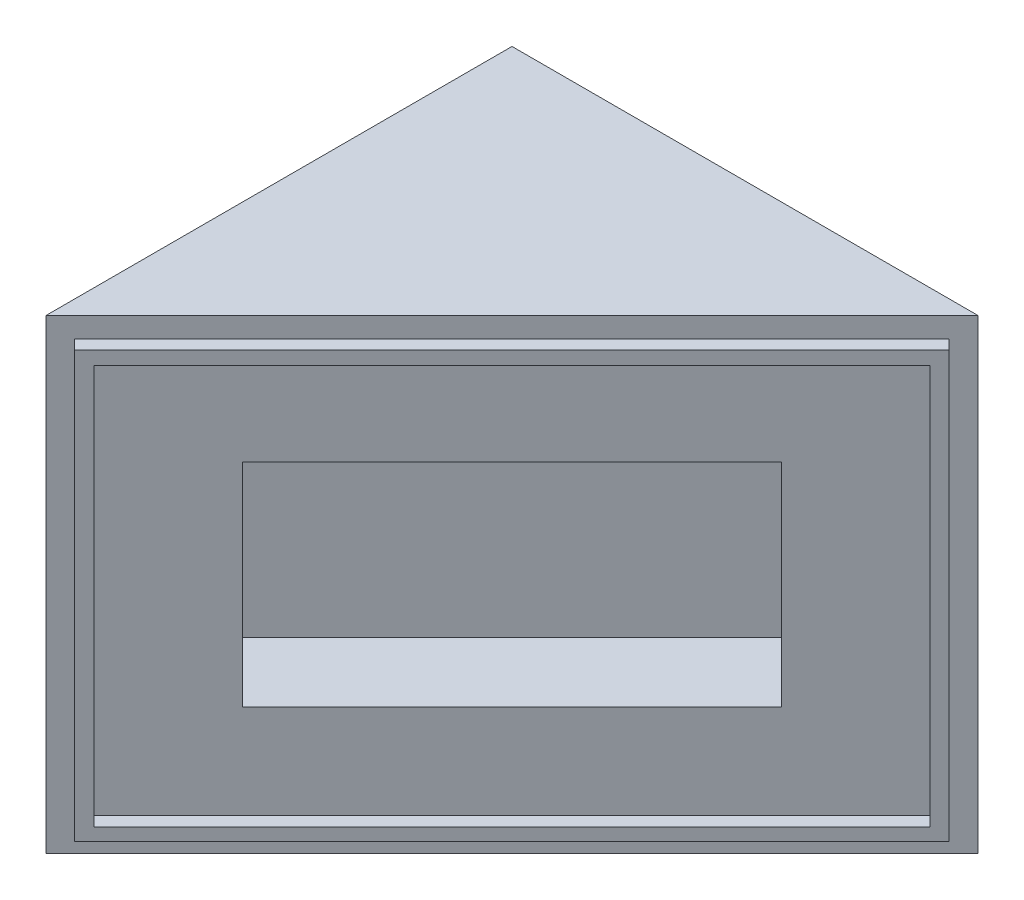
ISO-10303-21;
HEADER;
FILE_DESCRIPTION(('STEP AP214'),'2;1');
FILE_NAME('part.step','',(''),(''),'','','');
FILE_SCHEMA(('AUTOMOTIVE_DESIGN { 1 0 10303 214 1 1 1 1 }'));
ENDSEC;
DATA;
#1=APPLICATION_CONTEXT('core data for automotive mechanical design processes');
#2=APPLICATION_PROTOCOL_DEFINITION('international standard','automotive_design',2000,#1);
#3=PRODUCT_CONTEXT('',#1,'mechanical');
#4=PRODUCT('Part','Part','',(#3));
#5=PRODUCT_RELATED_PRODUCT_CATEGORY('part','',(#4));
#6=PRODUCT_DEFINITION_FORMATION('','',#4);
#7=PRODUCT_DEFINITION_CONTEXT('part definition',#1,'design');
#8=PRODUCT_DEFINITION('design','',#6,#7);
#9=PRODUCT_DEFINITION_SHAPE('','',#8);
#10=(LENGTH_UNIT() NAMED_UNIT(*) SI_UNIT(.MILLI.,.METRE.));
#11=(NAMED_UNIT(*) PLANE_ANGLE_UNIT() SI_UNIT($,.RADIAN.));
#12=(NAMED_UNIT(*) SI_UNIT($,.STERADIAN.) SOLID_ANGLE_UNIT());
#13=UNCERTAINTY_MEASURE_WITH_UNIT(LENGTH_MEASURE(1.E-05),#10,'distance_accuracy_value','');
#14=(GEOMETRIC_REPRESENTATION_CONTEXT(3) GLOBAL_UNCERTAINTY_ASSIGNED_CONTEXT((#13)) GLOBAL_UNIT_ASSIGNED_CONTEXT((#10,
#11,#12)) REPRESENTATION_CONTEXT('',''));
#15=CARTESIAN_POINT('',(0.,0.,0.));
#16=DIRECTION('',(0.,0.,1.));
#17=DIRECTION('',(1.,0.,0.));
#18=AXIS2_PLACEMENT_3D('',#15,#16,#17);
#19=CARTESIAN_POINT('',(0.,0.,0.));
#20=DIRECTION('',(0.707106781186547,0.,0.707106781186548));
#21=DIRECTION('',(0.707106781186548,0.,-0.707106781186547));
#22=AXIS2_PLACEMENT_3D('',#19,#20,#21);
#23=PLANE('',#22);
#24=DIRECTION('',(-0.707106781186548,0.,0.707106781186547));
#25=VECTOR('',#24,1.);
#26=CARTESIAN_POINT('',(34.925,69.85,-34.925));
#27=LINE('',#26,#25);
#28=CARTESIAN_POINT('',(69.85,69.85,-69.85));
#29=VERTEX_POINT('',#28);
#30=CARTESIAN_POINT('',(0.,69.85,0.));
#31=VERTEX_POINT('',#30);
#32=EDGE_CURVE('E281',#29,#31,#27,.T.);
#33=ORIENTED_EDGE('',*,*,#32,.T.);
#34=DIRECTION('',(0.,-1.,0.));
#35=VECTOR('',#34,1.);
#36=CARTESIAN_POINT('',(0.,69.85,0.));
#37=LINE('',#36,#35);
#38=CARTESIAN_POINT('',(0.,0.,0.));
#39=VERTEX_POINT('',#38);
#40=EDGE_CURVE('E11',#31,#39,#37,.T.);
#41=ORIENTED_EDGE('',*,*,#40,.T.);
#42=DIRECTION('',(0.707106781186548,0.,-0.707106781186547));
#43=VECTOR('',#42,1.);
#44=CARTESIAN_POINT('',(69.85,0.,-69.85));
#45=LINE('',#44,#43);
#46=CARTESIAN_POINT('',(69.85,0.,-69.85));
#47=VERTEX_POINT('',#46);
#48=EDGE_CURVE('E284',#39,#47,#45,.T.);
#49=ORIENTED_EDGE('',*,*,#48,.T.);
#50=DIRECTION('',(0.,-1.,0.));
#51=VECTOR('',#50,1.);
#52=CARTESIAN_POINT('',(69.85,69.85,-69.85));
#53=LINE('',#52,#51);
#54=EDGE_CURVE('E52',#29,#47,#53,.T.);
#55=ORIENTED_EDGE('',*,*,#54,.F.);
#56=EDGE_LOOP('',(#33,#41,#49,#55));
#57=FACE_BOUND('',#56,.T.);
#58=DIRECTION('',(-0.707106781186547,0.,0.707106781186548));
#59=VECTOR('',#58,1.);
#60=CARTESIAN_POINT('',(67.6947385309434,66.802,-67.6947385309434));
#61=LINE('',#60,#59);
#62=CARTESIAN_POINT('',(67.6947385309434,66.802,-67.6947385309434));
#63=VERTEX_POINT('',#62);
#64=CARTESIAN_POINT('',(2.12132034355964,66.802,-2.12132034355964));
#65=VERTEX_POINT('',#64);
#66=EDGE_CURVE('E261',#63,#65,#61,.T.);
#67=ORIENTED_EDGE('',*,*,#66,.F.);
#68=DIRECTION('',(0.,1.,0.));
#69=VECTOR('',#68,1.);
#70=CARTESIAN_POINT('',(67.6947385309434,3.,-67.6947385309434));
#71=LINE('',#70,#69);
#72=CARTESIAN_POINT('',(67.6947385309434,3.,-67.6947385309434));
#73=VERTEX_POINT('',#72);
#74=EDGE_CURVE('E242',#73,#63,#71,.T.);
#75=ORIENTED_EDGE('',*,*,#74,.F.);
#76=DIRECTION('',(0.707106781186547,0.,-0.707106781186548));
#77=VECTOR('',#76,1.);
#78=CARTESIAN_POINT('',(2.12132034355964,3.,-2.12132034355964));
#79=LINE('',#78,#77);
#80=CARTESIAN_POINT('',(2.12132034355964,3.,-2.12132034355964));
#81=VERTEX_POINT('',#80);
#82=EDGE_CURVE('E248',#81,#73,#79,.T.);
#83=ORIENTED_EDGE('',*,*,#82,.F.);
#84=DIRECTION('',(0.,-1.,0.));
#85=VECTOR('',#84,1.);
#86=CARTESIAN_POINT('',(2.12132034355964,66.802,-2.12132034355964));
#87=LINE('',#86,#85);
#88=EDGE_CURVE('E264',#65,#81,#87,.T.);
#89=ORIENTED_EDGE('',*,*,#88,.F.);
#90=EDGE_LOOP('',(#67,#75,#83,#89));
#91=FACE_BOUND('',#90,.T.);
#92=ADVANCED_FACE('F43',(#57,#91),#23,.T.);
#93=CARTESIAN_POINT('',(0.,69.85,0.));
#94=DIRECTION('',(0.,-1.,0.));
#95=DIRECTION('',(0.,0.,-1.));
#96=AXIS2_PLACEMENT_3D('',#93,#94,#95);
#97=PLANE('',#96);
#98=ORIENTED_EDGE('',*,*,#32,.F.);
#99=DIRECTION('',(-1.,0.,0.));
#100=VECTOR('',#99,1.);
#101=CARTESIAN_POINT('',(0.,69.85,-69.85));
#102=LINE('',#101,#100);
#103=CARTESIAN_POINT('',(0.,69.85,-69.85));
#104=VERTEX_POINT('',#103);
#105=EDGE_CURVE('E292',#29,#104,#102,.T.);
#106=ORIENTED_EDGE('',*,*,#105,.T.);
#107=DIRECTION('',(0.,0.,1.));
#108=VECTOR('',#107,1.);
#109=CARTESIAN_POINT('',(0.,69.85,0.));
#110=LINE('',#109,#108);
#111=EDGE_CURVE('E288',#104,#31,#110,.T.);
#112=ORIENTED_EDGE('',*,*,#111,.T.);
#113=EDGE_LOOP('',(#98,#106,#112));
#114=FACE_BOUND('',#113,.T.);
#115=ADVANCED_FACE('F321',(#114),#97,.F.);
#116=CARTESIAN_POINT('',(0.,0.,0.));
#117=DIRECTION('',(0.,-1.,0.));
#118=DIRECTION('',(0.,0.,-1.));
#119=AXIS2_PLACEMENT_3D('',#116,#117,#118);
#120=PLANE('',#119);
#121=DIRECTION('',(-1.,0.,0.));
#122=VECTOR('',#121,1.);
#123=CARTESIAN_POINT('',(0.,0.,-69.85));
#124=LINE('',#123,#122);
#125=CARTESIAN_POINT('',(0.,0.,-69.85));
#126=VERTEX_POINT('',#125);
#127=EDGE_CURVE('E293',#47,#126,#124,.T.);
#128=ORIENTED_EDGE('',*,*,#127,.F.);
#129=ORIENTED_EDGE('',*,*,#48,.F.);
#130=DIRECTION('',(0.,0.,1.));
#131=VECTOR('',#130,1.);
#132=CARTESIAN_POINT('',(0.,0.,0.));
#133=LINE('',#132,#131);
#134=EDGE_CURVE('E287',#126,#39,#133,.T.);
#135=ORIENTED_EDGE('',*,*,#134,.F.);
#136=EDGE_LOOP('',(#128,#129,#135));
#137=FACE_BOUND('',#136,.T.);
#138=ADVANCED_FACE('F316',(#137),#120,.T.);
#139=CARTESIAN_POINT('',(0.,69.85,0.));
#140=DIRECTION('',(1.,0.,0.));
#141=DIRECTION('',(0.,0.,-1.));
#142=AXIS2_PLACEMENT_3D('',#139,#140,#141);
#143=PLANE('',#142);
#144=ORIENTED_EDGE('',*,*,#134,.T.);
#145=ORIENTED_EDGE('',*,*,#40,.F.);
#146=ORIENTED_EDGE('',*,*,#111,.F.);
#147=DIRECTION('',(0.,-1.,0.));
#148=VECTOR('',#147,1.);
#149=CARTESIAN_POINT('',(0.,69.85,-69.85));
#150=LINE('',#149,#148);
#151=EDGE_CURVE('E296',#104,#126,#150,.T.);
#152=ORIENTED_EDGE('',*,*,#151,.T.);
#153=EDGE_LOOP('',(#144,#145,#146,#152));
#154=FACE_BOUND('',#153,.T.);
#155=ADVANCED_FACE('F45',(#154),#143,.F.);
#156=CARTESIAN_POINT('',(0.,69.85,-69.85));
#157=DIRECTION('',(0.,0.,1.));
#158=DIRECTION('',(1.,0.,0.));
#159=AXIS2_PLACEMENT_3D('',#156,#157,#158);
#160=PLANE('',#159);
#161=ORIENTED_EDGE('',*,*,#127,.T.);
#162=ORIENTED_EDGE('',*,*,#151,.F.);
#163=ORIENTED_EDGE('',*,*,#105,.F.);
#164=ORIENTED_EDGE('',*,*,#54,.T.);
#165=EDGE_LOOP('',(#161,#162,#163,#164));
#166=FACE_BOUND('',#165,.T.);
#167=ADVANCED_FACE('F309',(#166),#160,.F.);
#168=CARTESIAN_POINT('',(1.43684097937107,0.,1.43684097937107));
#169=DIRECTION('',(0.707106781186548,0.,0.707106781186547));
#170=DIRECTION('',(0.707106781186547,0.,-0.707106781186548));
#171=AXIS2_PLACEMENT_3D('',#168,#169,#170);
#172=PLANE('',#171);
#173=DIRECTION('',(0.,1.,0.));
#174=VECTOR('',#173,1.);
#175=CARTESIAN_POINT('',(69.1315795103144,3.,-66.2578975515723));
#176=LINE('',#175,#174);
#177=CARTESIAN_POINT('',(69.1315795103144,3.,-66.2578975515723));
#178=VERTEX_POINT('',#177);
#179=CARTESIAN_POINT('',(69.1315795103144,66.802,-66.2578975515723));
#180=VERTEX_POINT('',#179);
#181=EDGE_CURVE('E243',#178,#180,#176,.T.);
#182=ORIENTED_EDGE('',*,*,#181,.T.);
#183=DIRECTION('',(-0.707106781186547,0.,0.707106781186548));
#184=VECTOR('',#183,1.);
#185=CARTESIAN_POINT('',(69.1315795103144,66.802,-66.2578975515723));
#186=LINE('',#185,#184);
#187=CARTESIAN_POINT('',(3.5581613229307,66.802,-0.684479364188573));
#188=VERTEX_POINT('',#187);
#189=EDGE_CURVE('E247',#180,#188,#186,.T.);
#190=ORIENTED_EDGE('',*,*,#189,.T.);
#191=DIRECTION('',(0.,-1.,0.));
#192=VECTOR('',#191,1.);
#193=CARTESIAN_POINT('',(3.5581613229307,66.802,-0.684479364188573));
#194=LINE('',#193,#192);
#195=CARTESIAN_POINT('',(3.55816132293071,3.,-0.684479364188578));
#196=VERTEX_POINT('',#195);
#197=EDGE_CURVE('E251',#188,#196,#194,.T.);
#198=ORIENTED_EDGE('',*,*,#197,.T.);
#199=DIRECTION('',(0.707106781186547,0.,-0.707106781186548));
#200=VECTOR('',#199,1.);
#201=CARTESIAN_POINT('',(3.55816132293071,3.,-0.684479364188578));
#202=LINE('',#201,#200);
#203=EDGE_CURVE('E254',#196,#178,#202,.T.);
#204=ORIENTED_EDGE('',*,*,#203,.T.);
#205=EDGE_LOOP('',(#182,#190,#198,#204));
#206=FACE_BOUND('',#205,.T.);
#207=DIRECTION('',(-0.707106781186547,0.,0.707106781186548));
#208=VECTOR('',#207,1.);
#209=CARTESIAN_POINT('',(67.6947385309434,64.77,-64.8210565722012));
#210=LINE('',#209,#208);
#211=CARTESIAN_POINT('',(67.6947385309434,64.77,-64.8210565722012));
#212=VERTEX_POINT('',#211);
#213=CARTESIAN_POINT('',(5.0247003464403,64.77,-2.15101838769818));
#214=VERTEX_POINT('',#213);
#215=EDGE_CURVE('E205',#212,#214,#210,.T.);
#216=ORIENTED_EDGE('',*,*,#215,.F.);
#217=DIRECTION('',(0.,1.,0.));
#218=VECTOR('',#217,1.);
#219=CARTESIAN_POINT('',(67.6947385309434,4.91111507160911,-64.8210565722012));
#220=LINE('',#219,#218);
#221=CARTESIAN_POINT('',(67.6947385309434,4.91111507160911,-64.8210565722012));
#222=VERTEX_POINT('',#221);
#223=EDGE_CURVE('E202',#222,#212,#220,.T.);
#224=ORIENTED_EDGE('',*,*,#223,.F.);
#225=DIRECTION('',(0.707106781186547,0.,-0.707106781186548));
#226=VECTOR('',#225,1.);
#227=CARTESIAN_POINT('',(5.0247003464403,4.9111150716091,-2.15101838769818));
#228=LINE('',#227,#226);
#229=CARTESIAN_POINT('',(5.02470034644031,4.9111150716091,-2.15101838769818));
#230=VERTEX_POINT('',#229);
#231=EDGE_CURVE('E213',#230,#222,#228,.T.);
#232=ORIENTED_EDGE('',*,*,#231,.F.);
#233=DIRECTION('',(0.,-1.,0.));
#234=VECTOR('',#233,1.);
#235=CARTESIAN_POINT('',(5.0247003464403,64.77,-2.15101838769818));
#236=LINE('',#235,#234);
#237=EDGE_CURVE('E209',#214,#230,#236,.T.);
#238=ORIENTED_EDGE('',*,*,#237,.F.);
#239=EDGE_LOOP('',(#216,#224,#232,#238));
#240=FACE_BOUND('',#239,.T.);
#241=ADVANCED_FACE('F338',(#206,#240),#172,.T.);
#242=CARTESIAN_POINT('',(69.1315795103144,3.,-66.2578975515723));
#243=DIRECTION('',(-0.707106781186547,0.,0.707106781186548));
#244=DIRECTION('',(0.707106781186548,0.,0.707106781186547));
#245=AXIS2_PLACEMENT_3D('',#242,#243,#244);
#246=PLANE('',#245);
#247=ORIENTED_EDGE('',*,*,#74,.T.);
#248=DIRECTION('',(-0.707106781186548,0.,-0.707106781186547));
#249=VECTOR('',#248,1.);
#250=CARTESIAN_POINT('',(69.1315795103144,66.802,-66.2578975515723));
#251=LINE('',#250,#249);
#252=EDGE_CURVE('E278',#180,#63,#251,.T.);
#253=ORIENTED_EDGE('',*,*,#252,.F.);
#254=ORIENTED_EDGE('',*,*,#181,.F.);
#255=DIRECTION('',(-0.707106781186548,0.,-0.707106781186547));
#256=VECTOR('',#255,1.);
#257=CARTESIAN_POINT('',(69.1315795103144,3.,-66.2578975515723));
#258=LINE('',#257,#256);
#259=EDGE_CURVE('E257',#178,#73,#258,.T.);
#260=ORIENTED_EDGE('',*,*,#259,.T.);
#261=EDGE_LOOP('',(#247,#253,#254,#260));
#262=FACE_BOUND('',#261,.T.);
#263=ADVANCED_FACE('F343',(#262),#246,.F.);
#264=CARTESIAN_POINT('',(69.1315795103144,66.802,-66.2578975515723));
#265=DIRECTION('',(0.,-1.,0.));
#266=DIRECTION('',(0.,0.,-1.));
#267=AXIS2_PLACEMENT_3D('',#264,#265,#266);
#268=PLANE('',#267);
#269=ORIENTED_EDGE('',*,*,#66,.T.);
#270=DIRECTION('',(-0.707106781186548,0.,-0.707106781186547));
#271=VECTOR('',#270,1.);
#272=CARTESIAN_POINT('',(3.5581613229307,66.802,-0.684479364188573));
#273=LINE('',#272,#271);
#274=EDGE_CURVE('E274',#188,#65,#273,.T.);
#275=ORIENTED_EDGE('',*,*,#274,.F.);
#276=ORIENTED_EDGE('',*,*,#189,.F.);
#277=ORIENTED_EDGE('',*,*,#252,.T.);
#278=EDGE_LOOP('',(#269,#275,#276,#277));
#279=FACE_BOUND('',#278,.T.);
#280=ADVANCED_FACE('F332',(#279),#268,.F.);
#281=CARTESIAN_POINT('',(3.5581613229307,66.802,-0.684479364188573));
#282=DIRECTION('',(0.707106781186547,0.,-0.707106781186548));
#283=DIRECTION('',(-0.707106781186548,0.,-0.707106781186547));
#284=AXIS2_PLACEMENT_3D('',#281,#282,#283);
#285=PLANE('',#284);
#286=ORIENTED_EDGE('',*,*,#88,.T.);
#287=DIRECTION('',(-0.707106781186548,0.,-0.707106781186547));
#288=VECTOR('',#287,1.);
#289=CARTESIAN_POINT('',(3.55816132293071,3.,-0.684479364188578));
#290=LINE('',#289,#288);
#291=EDGE_CURVE('E67',#196,#81,#290,.T.);
#292=ORIENTED_EDGE('',*,*,#291,.F.);
#293=ORIENTED_EDGE('',*,*,#197,.F.);
#294=ORIENTED_EDGE('',*,*,#274,.T.);
#295=EDGE_LOOP('',(#286,#292,#293,#294));
#296=FACE_BOUND('',#295,.T.);
#297=ADVANCED_FACE('F336',(#296),#285,.F.);
#298=CARTESIAN_POINT('',(3.55816132293071,3.,-0.684479364188578));
#299=DIRECTION('',(0.,1.,0.));
#300=DIRECTION('',(0.,0.,1.));
#301=AXIS2_PLACEMENT_3D('',#298,#299,#300);
#302=PLANE('',#301);
#303=ORIENTED_EDGE('',*,*,#82,.T.);
#304=ORIENTED_EDGE('',*,*,#259,.F.);
#305=ORIENTED_EDGE('',*,*,#203,.F.);
#306=ORIENTED_EDGE('',*,*,#291,.T.);
#307=EDGE_LOOP('',(#303,#304,#305,#306));
#308=FACE_BOUND('',#307,.T.);
#309=ADVANCED_FACE('F344',(#308),#302,.F.);
#310=CARTESIAN_POINT('',(67.6947385309434,4.91111507160911,-64.8210565722012));
#311=DIRECTION('',(-0.707106781186547,0.,0.707106781186548));
#312=DIRECTION('',(0.707106781186548,0.,0.707106781186547));
#313=AXIS2_PLACEMENT_3D('',#310,#311,#312);
#314=PLANE('',#313);
#315=DIRECTION('',(0.,1.,0.));
#316=VECTOR('',#315,1.);
#317=CARTESIAN_POINT('',(66.2578975515723,4.91111507160911,-66.2578975515723));
#318=LINE('',#317,#316);
#319=CARTESIAN_POINT('',(66.2578975515723,4.91111507160911,-66.2578975515723));
#320=VERTEX_POINT('',#319);
#321=CARTESIAN_POINT('',(66.2578975515723,64.77,-66.2578975515723));
#322=VERTEX_POINT('',#321);
#323=EDGE_CURVE('E196',#320,#322,#318,.T.);
#324=ORIENTED_EDGE('',*,*,#323,.F.);
#325=DIRECTION('',(-0.707106781186548,0.,-0.707106781186547));
#326=VECTOR('',#325,1.);
#327=CARTESIAN_POINT('',(67.6947385309434,4.91111507160911,-64.8210565722012));
#328=LINE('',#327,#326);
#329=EDGE_CURVE('E216',#222,#320,#328,.T.);
#330=ORIENTED_EDGE('',*,*,#329,.F.);
#331=ORIENTED_EDGE('',*,*,#223,.T.);
#332=DIRECTION('',(-0.707106781186548,0.,-0.707106781186547));
#333=VECTOR('',#332,1.);
#334=CARTESIAN_POINT('',(67.6947385309434,64.77,-64.8210565722012));
#335=LINE('',#334,#333);
#336=EDGE_CURVE('E238',#212,#322,#335,.T.);
#337=ORIENTED_EDGE('',*,*,#336,.T.);
#338=EDGE_LOOP('',(#324,#330,#331,#337));
#339=FACE_BOUND('',#338,.T.);
#340=ADVANCED_FACE('F346',(#339),#314,.T.);
#341=CARTESIAN_POINT('',(67.6947385309434,64.77,-64.8210565722012));
#342=DIRECTION('',(0.,-1.,0.));
#343=DIRECTION('',(0.,0.,-1.));
#344=AXIS2_PLACEMENT_3D('',#341,#342,#343);
#345=PLANE('',#344);
#346=DIRECTION('',(-0.707106781186547,0.,0.707106781186548));
#347=VECTOR('',#346,1.);
#348=CARTESIAN_POINT('',(66.2578975515723,64.77,-66.2578975515723));
#349=LINE('',#348,#347);
#350=CARTESIAN_POINT('',(3.58785936706924,64.77,-3.58785936706924));
#351=VERTEX_POINT('',#350);
#352=EDGE_CURVE('E219',#322,#351,#349,.T.);
#353=ORIENTED_EDGE('',*,*,#352,.F.);
#354=ORIENTED_EDGE('',*,*,#336,.F.);
#355=ORIENTED_EDGE('',*,*,#215,.T.);
#356=DIRECTION('',(-0.707106781186548,0.,-0.707106781186547));
#357=VECTOR('',#356,1.);
#358=CARTESIAN_POINT('',(5.0247003464403,64.77,-2.15101838769818));
#359=LINE('',#358,#357);
#360=EDGE_CURVE('E234',#214,#351,#359,.T.);
#361=ORIENTED_EDGE('',*,*,#360,.T.);
#362=EDGE_LOOP('',(#353,#354,#355,#361));
#363=FACE_BOUND('',#362,.T.);
#364=ADVANCED_FACE('F352',(#363),#345,.T.);
#365=CARTESIAN_POINT('',(5.0247003464403,64.77,-2.15101838769818));
#366=DIRECTION('',(0.707106781186547,0.,-0.707106781186548));
#367=DIRECTION('',(-0.707106781186548,0.,-0.707106781186547));
#368=AXIS2_PLACEMENT_3D('',#365,#366,#367);
#369=PLANE('',#368);
#370=DIRECTION('',(0.,-1.,0.));
#371=VECTOR('',#370,1.);
#372=CARTESIAN_POINT('',(3.58785936706924,64.77,-3.58785936706924));
#373=LINE('',#372,#371);
#374=CARTESIAN_POINT('',(3.58785936706924,4.9111150716091,-3.58785936706924));
#375=VERTEX_POINT('',#374);
#376=EDGE_CURVE('E222',#351,#375,#373,.T.);
#377=ORIENTED_EDGE('',*,*,#376,.F.);
#378=ORIENTED_EDGE('',*,*,#360,.F.);
#379=ORIENTED_EDGE('',*,*,#237,.T.);
#380=DIRECTION('',(-0.707106781186548,0.,-0.707106781186547));
#381=VECTOR('',#380,1.);
#382=CARTESIAN_POINT('',(5.0247003464403,4.9111150716091,-2.15101838769818));
#383=LINE('',#382,#381);
#384=EDGE_CURVE('E230',#230,#375,#383,.T.);
#385=ORIENTED_EDGE('',*,*,#384,.T.);
#386=EDGE_LOOP('',(#377,#378,#379,#385));
#387=FACE_BOUND('',#386,.T.);
#388=ADVANCED_FACE('F440',(#387),#369,.T.);
#389=CARTESIAN_POINT('',(5.0247003464403,4.9111150716091,-2.15101838769818));
#390=DIRECTION('',(0.,1.,0.));
#391=DIRECTION('',(0.,0.,1.));
#392=AXIS2_PLACEMENT_3D('',#389,#390,#391);
#393=PLANE('',#392);
#394=DIRECTION('',(0.707106781186547,0.,-0.707106781186548));
#395=VECTOR('',#394,1.);
#396=CARTESIAN_POINT('',(3.58785936706924,4.9111150716091,-3.58785936706924));
#397=LINE('',#396,#395);
#398=EDGE_CURVE('E206',#375,#320,#397,.T.);
#399=ORIENTED_EDGE('',*,*,#398,.F.);
#400=ORIENTED_EDGE('',*,*,#384,.F.);
#401=ORIENTED_EDGE('',*,*,#231,.T.);
#402=ORIENTED_EDGE('',*,*,#329,.T.);
#403=EDGE_LOOP('',(#399,#400,#401,#402));
#404=FACE_BOUND('',#403,.T.);
#405=ADVANCED_FACE('F363',(#404),#393,.T.);
#406=DIRECTION('',(0.,1.,0.));
#407=VECTOR('',#406,1.);
#408=CARTESIAN_POINT('',(55.1305762724056,19.05,-55.1305762724056));
#409=LINE('',#408,#407);
#410=CARTESIAN_POINT('',(55.1305762724056,19.05,-55.1305762724056));
#411=VERTEX_POINT('',#410);
#412=CARTESIAN_POINT('',(55.1305762724056,50.8,-55.1305762724056));
#413=VERTEX_POINT('',#412);
#414=EDGE_CURVE('E59',#411,#413,#409,.T.);
#415=ORIENTED_EDGE('',*,*,#414,.F.);
#416=DIRECTION('',(0.707106781186547,0.,-0.707106781186548));
#417=VECTOR('',#416,1.);
#418=CARTESIAN_POINT('',(14.7194237275944,19.05,-14.7194237275944));
#419=LINE('',#418,#417);
#420=CARTESIAN_POINT('',(14.7194237275944,19.05,-14.7194237275944));
#421=VERTEX_POINT('',#420);
#422=EDGE_CURVE('E174',#421,#411,#419,.T.);
#423=ORIENTED_EDGE('',*,*,#422,.F.);
#424=DIRECTION('',(0.,-1.,0.));
#425=VECTOR('',#424,1.);
#426=CARTESIAN_POINT('',(14.7194237275944,19.05,-14.7194237275944));
#427=LINE('',#426,#425);
#428=CARTESIAN_POINT('',(14.7194237275944,50.8,-14.7194237275944));
#429=VERTEX_POINT('',#428);
#430=EDGE_CURVE('E178',#429,#421,#427,.T.);
#431=ORIENTED_EDGE('',*,*,#430,.F.);
#432=DIRECTION('',(-0.707106781186547,0.,0.707106781186548));
#433=VECTOR('',#432,1.);
#434=CARTESIAN_POINT('',(14.7194237275944,50.8,-14.7194237275944));
#435=LINE('',#434,#433);
#436=EDGE_CURVE('E187',#413,#429,#435,.T.);
#437=ORIENTED_EDGE('',*,*,#436,.F.);
#438=EDGE_LOOP('',(#415,#423,#431,#437));
#439=FACE_BOUND('',#438,.T.);
#440=ORIENTED_EDGE('',*,*,#323,.T.);
#441=ORIENTED_EDGE('',*,*,#352,.T.);
#442=ORIENTED_EDGE('',*,*,#376,.T.);
#443=ORIENTED_EDGE('',*,*,#398,.T.);
#444=EDGE_LOOP('',(#440,#441,#442,#443));
#445=FACE_BOUND('',#444,.T.);
#446=ADVANCED_FACE('F325',(#439,#445),#23,.T.);
#447=CARTESIAN_POINT('',(46.1503201513364,19.05,-64.1108323934748));
#448=DIRECTION('',(0.707106781186547,0.,-0.707106781186548));
#449=DIRECTION('',(-0.707106781186548,0.,-0.707106781186547));
#450=AXIS2_PLACEMENT_3D('',#447,#448,#449);
#451=PLANE('',#450);
#452=ORIENTED_EDGE('',*,*,#414,.T.);
#453=DIRECTION('',(0.707106781186548,0.,0.707106781186547));
#454=VECTOR('',#453,1.);
#455=CARTESIAN_POINT('',(46.1503201513364,50.8,-64.1108323934748));
#456=LINE('',#455,#454);
#457=CARTESIAN_POINT('',(46.1503201513364,50.8,-64.1108323934748));
#458=VERTEX_POINT('',#457);
#459=EDGE_CURVE('E149',#458,#413,#456,.T.);
#460=ORIENTED_EDGE('',*,*,#459,.F.);
#461=DIRECTION('',(0.,1.,0.));
#462=VECTOR('',#461,1.);
#463=CARTESIAN_POINT('',(46.1503201513364,19.05,-64.1108323934748));
#464=LINE('',#463,#462);
#465=CARTESIAN_POINT('',(46.1503201513364,19.05,-64.1108323934748));
#466=VERTEX_POINT('',#465);
#467=EDGE_CURVE('E153',#466,#458,#464,.T.);
#468=ORIENTED_EDGE('',*,*,#467,.F.);
#469=DIRECTION('',(0.707106781186548,0.,0.707106781186547));
#470=VECTOR('',#469,1.);
#471=CARTESIAN_POINT('',(46.1503201513364,19.05,-64.1108323934748));
#472=LINE('',#471,#470);
#473=EDGE_CURVE('E193',#466,#411,#472,.T.);
#474=ORIENTED_EDGE('',*,*,#473,.T.);
#475=EDGE_LOOP('',(#452,#460,#468,#474));
#476=FACE_BOUND('',#475,.T.);
#477=ADVANCED_FACE('F151',(#476),#451,.F.);
#478=CARTESIAN_POINT('',(5.73916760652524,19.05,-23.6996798486636));
#479=DIRECTION('',(0.,-1.,0.));
#480=DIRECTION('',(0.,0.,-1.));
#481=AXIS2_PLACEMENT_3D('',#478,#479,#480);
#482=PLANE('',#481);
#483=ORIENTED_EDGE('',*,*,#422,.T.);
#484=ORIENTED_EDGE('',*,*,#473,.F.);
#485=DIRECTION('',(0.707106781186547,0.,-0.707106781186548));
#486=VECTOR('',#485,1.);
#487=CARTESIAN_POINT('',(5.73916760652524,19.05,-23.6996798486636));
#488=LINE('',#487,#486);
#489=CARTESIAN_POINT('',(5.73916760652524,19.05,-23.6996798486636));
#490=VERTEX_POINT('',#489);
#491=EDGE_CURVE('E160',#490,#466,#488,.T.);
#492=ORIENTED_EDGE('',*,*,#491,.F.);
#493=DIRECTION('',(0.707106781186548,0.,0.707106781186547));
#494=VECTOR('',#493,1.);
#495=CARTESIAN_POINT('',(5.73916760652524,19.05,-23.6996798486636));
#496=LINE('',#495,#494);
#497=EDGE_CURVE('E197',#490,#421,#496,.T.);
#498=ORIENTED_EDGE('',*,*,#497,.T.);
#499=EDGE_LOOP('',(#483,#484,#492,#498));
#500=FACE_BOUND('',#499,.T.);
#501=ADVANCED_FACE('F478',(#500),#482,.F.);
#502=CARTESIAN_POINT('',(5.73916760652524,19.05,-23.6996798486636));
#503=DIRECTION('',(-0.707106781186547,0.,0.707106781186548));
#504=DIRECTION('',(0.707106781186548,0.,0.707106781186547));
#505=AXIS2_PLACEMENT_3D('',#502,#503,#504);
#506=PLANE('',#505);
#507=ORIENTED_EDGE('',*,*,#430,.T.);
#508=ORIENTED_EDGE('',*,*,#497,.F.);
#509=DIRECTION('',(0.,-1.,0.));
#510=VECTOR('',#509,1.);
#511=CARTESIAN_POINT('',(5.73916760652524,19.05,-23.6996798486636));
#512=LINE('',#511,#510);
#513=CARTESIAN_POINT('',(5.73916760652524,50.8,-23.6996798486636));
#514=VERTEX_POINT('',#513);
#515=EDGE_CURVE('E169',#514,#490,#512,.T.);
#516=ORIENTED_EDGE('',*,*,#515,.F.);
#517=DIRECTION('',(0.707106781186548,0.,0.707106781186547));
#518=VECTOR('',#517,1.);
#519=CARTESIAN_POINT('',(5.73916760652524,50.8,-23.6996798486636));
#520=LINE('',#519,#518);
#521=EDGE_CURVE('E159',#514,#429,#520,.T.);
#522=ORIENTED_EDGE('',*,*,#521,.T.);
#523=EDGE_LOOP('',(#507,#508,#516,#522));
#524=FACE_BOUND('',#523,.T.);
#525=ADVANCED_FACE('F488',(#524),#506,.F.);
#526=CARTESIAN_POINT('',(5.73916760652524,50.8,-23.6996798486636));
#527=DIRECTION('',(0.,1.,0.));
#528=DIRECTION('',(0.,0.,1.));
#529=AXIS2_PLACEMENT_3D('',#526,#527,#528);
#530=PLANE('',#529);
#531=ORIENTED_EDGE('',*,*,#436,.T.);
#532=ORIENTED_EDGE('',*,*,#521,.F.);
#533=DIRECTION('',(-0.707106781186547,0.,0.707106781186548));
#534=VECTOR('',#533,1.);
#535=CARTESIAN_POINT('',(5.73916760652524,50.8,-23.6996798486636));
#536=LINE('',#535,#534);
#537=EDGE_CURVE('E163',#458,#514,#536,.T.);
#538=ORIENTED_EDGE('',*,*,#537,.F.);
#539=ORIENTED_EDGE('',*,*,#459,.T.);
#540=EDGE_LOOP('',(#531,#532,#538,#539));
#541=FACE_BOUND('',#540,.T.);
#542=ADVANCED_FACE('F164',(#541),#530,.F.);
#543=CARTESIAN_POINT('',(-8.98025612106916,0.,-8.98025612106915));
#544=DIRECTION('',(-0.707106781186548,0.,-0.707106781186547));
#545=DIRECTION('',(-0.707106781186547,0.,0.707106781186548));
#546=AXIS2_PLACEMENT_3D('',#543,#544,#545);
#547=PLANE('',#546);
#548=ORIENTED_EDGE('',*,*,#467,.T.);
#549=ORIENTED_EDGE('',*,*,#537,.T.);
#550=ORIENTED_EDGE('',*,*,#515,.T.);
#551=ORIENTED_EDGE('',*,*,#491,.T.);
#552=EDGE_LOOP('',(#548,#549,#550,#551));
#553=FACE_BOUND('',#552,.T.);
#554=ADVANCED_FACE('F171',(#553),#547,.F.);
#555=CLOSED_SHELL('',(#92,#115,#138,#155,#167,#241,#263,#280,#297,#309,#340,#364,#388,#405,#446,
#477,#501,#525,#542,#554));
#556=MANIFOLD_SOLID_BREP('B2',#555);
#557=ADVANCED_BREP_SHAPE_REPRESENTATION('',(#18,#556),#14);
#558=SHAPE_DEFINITION_REPRESENTATION(#9,#557);
ENDSEC;
END-ISO-10303-21;
